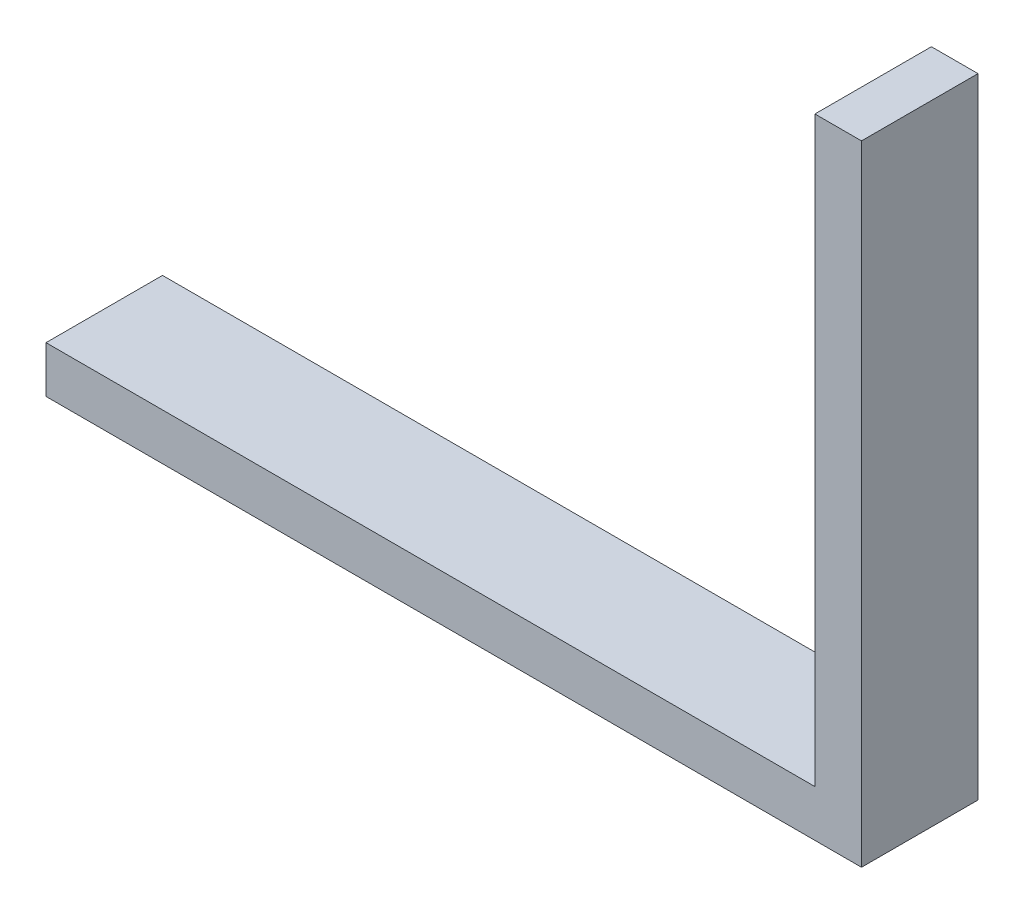
ISO-10303-21;
HEADER;
FILE_DESCRIPTION(('STEP AP214'),'2;1');
FILE_NAME('part.step','',(''),(''),'','','');
FILE_SCHEMA(('AUTOMOTIVE_DESIGN { 1 0 10303 214 1 1 1 1 }'));
ENDSEC;
DATA;
#1=APPLICATION_CONTEXT('core data for automotive mechanical design processes');
#2=APPLICATION_PROTOCOL_DEFINITION('international standard','automotive_design',2000,#1);
#3=PRODUCT_CONTEXT('',#1,'mechanical');
#4=PRODUCT('Part','Part','',(#3));
#5=PRODUCT_RELATED_PRODUCT_CATEGORY('part','',(#4));
#6=PRODUCT_DEFINITION_FORMATION('','',#4);
#7=PRODUCT_DEFINITION_CONTEXT('part definition',#1,'design');
#8=PRODUCT_DEFINITION('design','',#6,#7);
#9=PRODUCT_DEFINITION_SHAPE('','',#8);
#10=(LENGTH_UNIT() NAMED_UNIT(*) SI_UNIT(.MILLI.,.METRE.));
#11=(NAMED_UNIT(*) PLANE_ANGLE_UNIT() SI_UNIT($,.RADIAN.));
#12=(NAMED_UNIT(*) SI_UNIT($,.STERADIAN.) SOLID_ANGLE_UNIT());
#13=UNCERTAINTY_MEASURE_WITH_UNIT(LENGTH_MEASURE(1.E-05),#10,'distance_accuracy_value','');
#14=(GEOMETRIC_REPRESENTATION_CONTEXT(3) GLOBAL_UNCERTAINTY_ASSIGNED_CONTEXT((#13)) GLOBAL_UNIT_ASSIGNED_CONTEXT((#10,
#11,#12)) REPRESENTATION_CONTEXT('',''));
#15=CARTESIAN_POINT('',(0.,0.,0.));
#16=DIRECTION('',(0.,0.,1.));
#17=DIRECTION('',(1.,0.,0.));
#18=AXIS2_PLACEMENT_3D('',#15,#16,#17);
#19=CARTESIAN_POINT('',(17.5,2.,-2.5));
#20=DIRECTION('',(-1.,0.,0.));
#21=DIRECTION('',(0.,0.,1.));
#22=AXIS2_PLACEMENT_3D('',#19,#20,#21);
#23=PLANE('',#22);
#24=DIRECTION('',(0.,0.,-1.));
#25=VECTOR('',#24,1.);
#26=CARTESIAN_POINT('',(17.5,0.,-2.5));
#27=LINE('',#26,#25);
#28=CARTESIAN_POINT('',(17.5,0.,2.5));
#29=VERTEX_POINT('',#28);
#30=CARTESIAN_POINT('',(17.5,0.,-2.5));
#31=VERTEX_POINT('',#30);
#32=EDGE_CURVE('E99',#29,#31,#27,.T.);
#33=ORIENTED_EDGE('',*,*,#32,.T.);
#34=DIRECTION('',(0.,-1.,0.));
#35=VECTOR('',#34,1.);
#36=CARTESIAN_POINT('',(17.5,2.,-2.5));
#37=LINE('',#36,#35);
#38=CARTESIAN_POINT('',(17.5,27.,-2.5));
#39=VERTEX_POINT('',#38);
#40=EDGE_CURVE('E11',#39,#31,#37,.T.);
#41=ORIENTED_EDGE('',*,*,#40,.F.);
#42=DIRECTION('',(0.,0.,-1.));
#43=VECTOR('',#42,1.);
#44=CARTESIAN_POINT('',(17.5,27.,-2.5));
#45=LINE('',#44,#43);
#46=CARTESIAN_POINT('',(17.5,27.,2.5));
#47=VERTEX_POINT('',#46);
#48=EDGE_CURVE('E101',#47,#39,#45,.T.);
#49=ORIENTED_EDGE('',*,*,#48,.F.);
#50=DIRECTION('',(0.,-1.,0.));
#51=VECTOR('',#50,1.);
#52=CARTESIAN_POINT('',(17.5,2.,2.5));
#53=LINE('',#52,#51);
#54=EDGE_CURVE('E84',#47,#29,#53,.T.);
#55=ORIENTED_EDGE('',*,*,#54,.T.);
#56=EDGE_LOOP('',(#33,#41,#49,#55));
#57=FACE_BOUND('',#56,.T.);
#58=ADVANCED_FACE('F39',(#57),#23,.F.);
#59=CARTESIAN_POINT('',(-17.5,2.,-2.5));
#60=DIRECTION('',(0.,0.,1.));
#61=DIRECTION('',(1.,0.,0.));
#62=AXIS2_PLACEMENT_3D('',#59,#60,#61);
#63=PLANE('',#62);
#64=DIRECTION('',(-1.,0.,0.));
#65=VECTOR('',#64,1.);
#66=CARTESIAN_POINT('',(-17.5,0.,-2.5));
#67=LINE('',#66,#65);
#68=CARTESIAN_POINT('',(-17.5,0.,-2.5));
#69=VERTEX_POINT('',#68);
#70=EDGE_CURVE('E106',#31,#69,#67,.T.);
#71=ORIENTED_EDGE('',*,*,#70,.T.);
#72=DIRECTION('',(0.,-1.,0.));
#73=VECTOR('',#72,1.);
#74=CARTESIAN_POINT('',(-17.5,2.,-2.5));
#75=LINE('',#74,#73);
#76=CARTESIAN_POINT('',(-17.5,2.,-2.5));
#77=VERTEX_POINT('',#76);
#78=EDGE_CURVE('E47',#77,#69,#75,.T.);
#79=ORIENTED_EDGE('',*,*,#78,.F.);
#80=DIRECTION('',(-1.,0.,0.));
#81=VECTOR('',#80,1.);
#82=CARTESIAN_POINT('',(-17.5,2.,-2.5));
#83=LINE('',#82,#81);
#84=CARTESIAN_POINT('',(15.5,2.,-2.5));
#85=VERTEX_POINT('',#84);
#86=EDGE_CURVE('E92',#85,#77,#83,.T.);
#87=ORIENTED_EDGE('',*,*,#86,.F.);
#88=DIRECTION('',(0.,-1.,0.));
#89=VECTOR('',#88,1.);
#90=CARTESIAN_POINT('',(15.5,27.,-2.5));
#91=LINE('',#90,#89);
#92=CARTESIAN_POINT('',(15.5,27.,-2.5));
#93=VERTEX_POINT('',#92);
#94=EDGE_CURVE('E108',#93,#85,#91,.T.);
#95=ORIENTED_EDGE('',*,*,#94,.F.);
#96=DIRECTION('',(-1.,0.,0.));
#97=VECTOR('',#96,1.);
#98=CARTESIAN_POINT('',(17.5,27.,-2.5));
#99=LINE('',#98,#97);
#100=EDGE_CURVE('E133',#39,#93,#99,.T.);
#101=ORIENTED_EDGE('',*,*,#100,.F.);
#102=ORIENTED_EDGE('',*,*,#40,.T.);
#103=EDGE_LOOP('',(#71,#79,#87,#95,#101,#102));
#104=FACE_BOUND('',#103,.T.);
#105=ADVANCED_FACE('F128',(#104),#63,.F.);
#106=CARTESIAN_POINT('',(-17.5,2.,-2.5));
#107=DIRECTION('',(1.,0.,0.));
#108=DIRECTION('',(0.,0.,-1.));
#109=AXIS2_PLACEMENT_3D('',#106,#107,#108);
#110=PLANE('',#109);
#111=DIRECTION('',(0.,0.,1.));
#112=VECTOR('',#111,1.);
#113=CARTESIAN_POINT('',(-17.5,0.,-2.5));
#114=LINE('',#113,#112);
#115=CARTESIAN_POINT('',(-17.5,0.,2.5));
#116=VERTEX_POINT('',#115);
#117=EDGE_CURVE('E93',#69,#116,#114,.T.);
#118=ORIENTED_EDGE('',*,*,#117,.T.);
#119=DIRECTION('',(0.,-1.,0.));
#120=VECTOR('',#119,1.);
#121=CARTESIAN_POINT('',(-17.5,2.,2.5));
#122=LINE('',#121,#120);
#123=CARTESIAN_POINT('',(-17.5,2.,2.5));
#124=VERTEX_POINT('',#123);
#125=EDGE_CURVE('E87',#124,#116,#122,.T.);
#126=ORIENTED_EDGE('',*,*,#125,.F.);
#127=DIRECTION('',(0.,0.,1.));
#128=VECTOR('',#127,1.);
#129=CARTESIAN_POINT('',(-17.5,2.,-2.5));
#130=LINE('',#129,#128);
#131=EDGE_CURVE('E60',#77,#124,#130,.T.);
#132=ORIENTED_EDGE('',*,*,#131,.F.);
#133=ORIENTED_EDGE('',*,*,#78,.T.);
#134=EDGE_LOOP('',(#118,#126,#132,#133));
#135=FACE_BOUND('',#134,.T.);
#136=ADVANCED_FACE('F126',(#135),#110,.F.);
#137=CARTESIAN_POINT('',(-17.5,2.,2.5));
#138=DIRECTION('',(0.,0.,-1.));
#139=DIRECTION('',(-1.,0.,0.));
#140=AXIS2_PLACEMENT_3D('',#137,#138,#139);
#141=PLANE('',#140);
#142=DIRECTION('',(1.,0.,0.));
#143=VECTOR('',#142,1.);
#144=CARTESIAN_POINT('',(-17.5,0.,2.5));
#145=LINE('',#144,#143);
#146=EDGE_CURVE('E80',#116,#29,#145,.T.);
#147=ORIENTED_EDGE('',*,*,#146,.T.);
#148=ORIENTED_EDGE('',*,*,#54,.F.);
#149=DIRECTION('',(1.,0.,0.));
#150=VECTOR('',#149,1.);
#151=CARTESIAN_POINT('',(17.5,27.,2.5));
#152=LINE('',#151,#150);
#153=CARTESIAN_POINT('',(15.5,27.,2.5));
#154=VERTEX_POINT('',#153);
#155=EDGE_CURVE('E147',#154,#47,#152,.T.);
#156=ORIENTED_EDGE('',*,*,#155,.F.);
#157=DIRECTION('',(0.,-1.,0.));
#158=VECTOR('',#157,1.);
#159=CARTESIAN_POINT('',(15.5,27.,2.5));
#160=LINE('',#159,#158);
#161=CARTESIAN_POINT('',(15.5,2.,2.5));
#162=VERTEX_POINT('',#161);
#163=EDGE_CURVE('E114',#154,#162,#160,.T.);
#164=ORIENTED_EDGE('',*,*,#163,.T.);
#165=DIRECTION('',(1.,0.,0.));
#166=VECTOR('',#165,1.);
#167=CARTESIAN_POINT('',(-17.5,2.,2.5));
#168=LINE('',#167,#166);
#169=EDGE_CURVE('E103',#124,#162,#168,.T.);
#170=ORIENTED_EDGE('',*,*,#169,.F.);
#171=ORIENTED_EDGE('',*,*,#125,.T.);
#172=EDGE_LOOP('',(#147,#148,#156,#164,#170,#171));
#173=FACE_BOUND('',#172,.T.);
#174=ADVANCED_FACE('F82',(#173),#141,.F.);
#175=CARTESIAN_POINT('',(0.,2.,0.));
#176=DIRECTION('',(0.,1.,0.));
#177=DIRECTION('',(0.,0.,1.));
#178=AXIS2_PLACEMENT_3D('',#175,#176,#177);
#179=PLANE('',#178);
#180=DIRECTION('',(0.,0.,1.));
#181=VECTOR('',#180,1.);
#182=CARTESIAN_POINT('',(15.5,2.,-2.5));
#183=LINE('',#182,#181);
#184=EDGE_CURVE('E54',#85,#162,#183,.T.);
#185=ORIENTED_EDGE('',*,*,#184,.F.);
#186=ORIENTED_EDGE('',*,*,#86,.T.);
#187=ORIENTED_EDGE('',*,*,#131,.T.);
#188=ORIENTED_EDGE('',*,*,#169,.T.);
#189=EDGE_LOOP('',(#185,#186,#187,#188));
#190=FACE_BOUND('',#189,.T.);
#191=ADVANCED_FACE('F164',(#190),#179,.T.);
#192=CARTESIAN_POINT('',(0.,0.,0.));
#193=DIRECTION('',(0.,1.,0.));
#194=DIRECTION('',(0.,0.,1.));
#195=AXIS2_PLACEMENT_3D('',#192,#193,#194);
#196=PLANE('',#195);
#197=ORIENTED_EDGE('',*,*,#32,.F.);
#198=ORIENTED_EDGE('',*,*,#146,.F.);
#199=ORIENTED_EDGE('',*,*,#117,.F.);
#200=ORIENTED_EDGE('',*,*,#70,.F.);
#201=EDGE_LOOP('',(#197,#198,#199,#200));
#202=FACE_BOUND('',#201,.T.);
#203=ADVANCED_FACE('F105',(#202),#196,.F.);
#204=CARTESIAN_POINT('',(15.5,27.,-2.5));
#205=DIRECTION('',(1.,0.,0.));
#206=DIRECTION('',(0.,0.,-1.));
#207=AXIS2_PLACEMENT_3D('',#204,#205,#206);
#208=PLANE('',#207);
#209=ORIENTED_EDGE('',*,*,#184,.T.);
#210=ORIENTED_EDGE('',*,*,#163,.F.);
#211=DIRECTION('',(0.,0.,1.));
#212=VECTOR('',#211,1.);
#213=CARTESIAN_POINT('',(15.5,27.,-2.5));
#214=LINE('',#213,#212);
#215=EDGE_CURVE('E144',#93,#154,#214,.T.);
#216=ORIENTED_EDGE('',*,*,#215,.F.);
#217=ORIENTED_EDGE('',*,*,#94,.T.);
#218=EDGE_LOOP('',(#209,#210,#216,#217));
#219=FACE_BOUND('',#218,.T.);
#220=ADVANCED_FACE('F152',(#219),#208,.F.);
#221=CARTESIAN_POINT('',(0.,27.,0.));
#222=DIRECTION('',(0.,-1.,0.));
#223=DIRECTION('',(0.,0.,-1.));
#224=AXIS2_PLACEMENT_3D('',#221,#222,#223);
#225=PLANE('',#224);
#226=ORIENTED_EDGE('',*,*,#48,.T.);
#227=ORIENTED_EDGE('',*,*,#100,.T.);
#228=ORIENTED_EDGE('',*,*,#215,.T.);
#229=ORIENTED_EDGE('',*,*,#155,.T.);
#230=EDGE_LOOP('',(#226,#227,#228,#229));
#231=FACE_BOUND('',#230,.T.);
#232=ADVANCED_FACE('F146',(#231),#225,.F.);
#233=CLOSED_SHELL('',(#58,#105,#136,#174,#191,#203,#220,#232));
#234=MANIFOLD_SOLID_BREP('B2',#233);
#235=ADVANCED_BREP_SHAPE_REPRESENTATION('',(#18,#234),#14);
#236=SHAPE_DEFINITION_REPRESENTATION(#9,#235);
ENDSEC;
END-ISO-10303-21;
